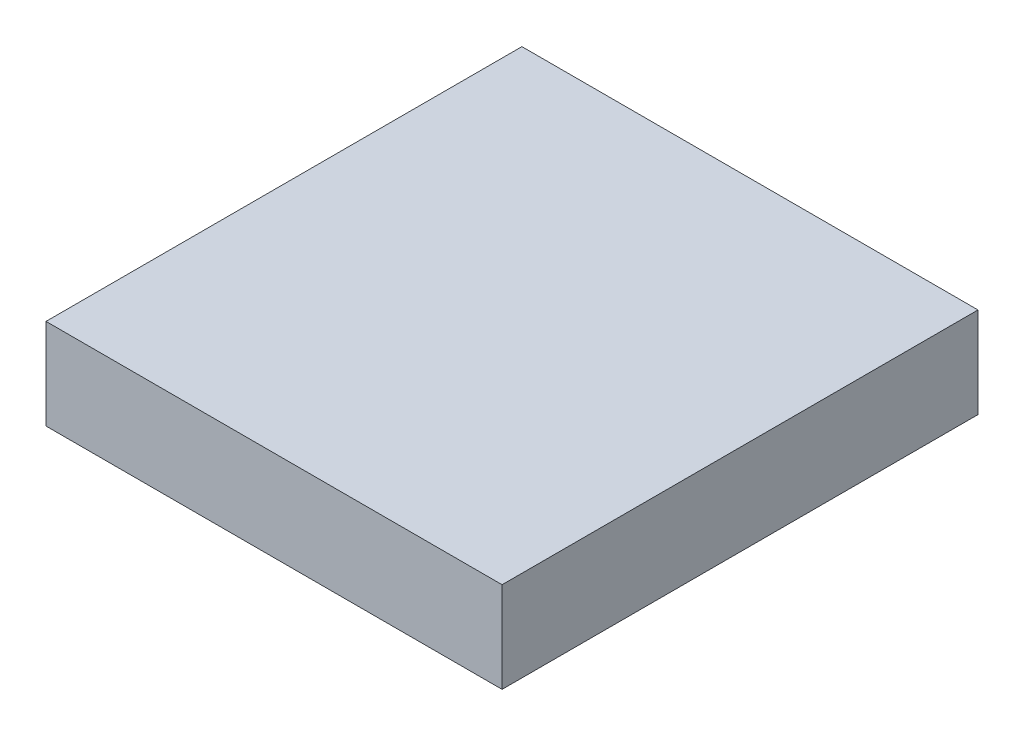
ISO-10303-21;
HEADER;
FILE_DESCRIPTION(('STEP AP214'),'2;1');
FILE_NAME('part.step','',(''),(''),'','','');
FILE_SCHEMA(('AUTOMOTIVE_DESIGN { 1 0 10303 214 1 1 1 1 }'));
ENDSEC;
DATA;
#1=APPLICATION_CONTEXT('core data for automotive mechanical design processes');
#2=APPLICATION_PROTOCOL_DEFINITION('international standard','automotive_design',2000,#1);
#3=PRODUCT_CONTEXT('',#1,'mechanical');
#4=PRODUCT('Part','Part','',(#3));
#5=PRODUCT_RELATED_PRODUCT_CATEGORY('part','',(#4));
#6=PRODUCT_DEFINITION_FORMATION('','',#4);
#7=PRODUCT_DEFINITION_CONTEXT('part definition',#1,'design');
#8=PRODUCT_DEFINITION('design','',#6,#7);
#9=PRODUCT_DEFINITION_SHAPE('','',#8);
#10=(LENGTH_UNIT() NAMED_UNIT(*) SI_UNIT(.MILLI.,.METRE.));
#11=(NAMED_UNIT(*) PLANE_ANGLE_UNIT() SI_UNIT($,.RADIAN.));
#12=(NAMED_UNIT(*) SI_UNIT($,.STERADIAN.) SOLID_ANGLE_UNIT());
#13=UNCERTAINTY_MEASURE_WITH_UNIT(LENGTH_MEASURE(1.E-05),#10,'distance_accuracy_value','');
#14=(GEOMETRIC_REPRESENTATION_CONTEXT(3) GLOBAL_UNCERTAINTY_ASSIGNED_CONTEXT((#13)) GLOBAL_UNIT_ASSIGNED_CONTEXT((#10,
#11,#12)) REPRESENTATION_CONTEXT('',''));
#15=CARTESIAN_POINT('',(0.,0.,0.));
#16=DIRECTION('',(0.,0.,1.));
#17=DIRECTION('',(1.,0.,0.));
#18=AXIS2_PLACEMENT_3D('',#15,#16,#17);
#19=CARTESIAN_POINT('',(-8.05,3.2,-8.4));
#20=DIRECTION('',(1.,0.,0.));
#21=DIRECTION('',(0.,0.,-1.));
#22=AXIS2_PLACEMENT_3D('',#19,#20,#21);
#23=PLANE('',#22);
#24=DIRECTION('',(0.,0.,1.));
#25=VECTOR('',#24,1.);
#26=CARTESIAN_POINT('',(-8.05,0.,-8.4));
#27=LINE('',#26,#25);
#28=CARTESIAN_POINT('',(-8.05,0.,-8.4));
#29=VERTEX_POINT('',#28);
#30=CARTESIAN_POINT('',(-8.05,0.,8.4));
#31=VERTEX_POINT('',#30);
#32=EDGE_CURVE('E98',#29,#31,#27,.T.);
#33=ORIENTED_EDGE('',*,*,#32,.T.);
#34=DIRECTION('',(0.,-1.,0.));
#35=VECTOR('',#34,1.);
#36=CARTESIAN_POINT('',(-8.05,3.2,8.4));
#37=LINE('',#36,#35);
#38=CARTESIAN_POINT('',(-8.05,3.2,8.4));
#39=VERTEX_POINT('',#38);
#40=EDGE_CURVE('E11',#39,#31,#37,.T.);
#41=ORIENTED_EDGE('',*,*,#40,.F.);
#42=DIRECTION('',(0.,0.,1.));
#43=VECTOR('',#42,1.);
#44=CARTESIAN_POINT('',(-8.05,3.2,-8.4));
#45=LINE('',#44,#43);
#46=CARTESIAN_POINT('',(-8.05,3.2,-8.4));
#47=VERTEX_POINT('',#46);
#48=EDGE_CURVE('E86',#47,#39,#45,.T.);
#49=ORIENTED_EDGE('',*,*,#48,.F.);
#50=DIRECTION('',(0.,-1.,0.));
#51=VECTOR('',#50,1.);
#52=CARTESIAN_POINT('',(-8.05,3.2,-8.4));
#53=LINE('',#52,#51);
#54=EDGE_CURVE('E94',#47,#29,#53,.T.);
#55=ORIENTED_EDGE('',*,*,#54,.T.);
#56=EDGE_LOOP('',(#33,#41,#49,#55));
#57=FACE_BOUND('',#56,.T.);
#58=ADVANCED_FACE('F35',(#57),#23,.F.);
#59=CARTESIAN_POINT('',(-8.05,3.2,8.4));
#60=DIRECTION('',(0.,0.,-1.));
#61=DIRECTION('',(-1.,0.,0.));
#62=AXIS2_PLACEMENT_3D('',#59,#60,#61);
#63=PLANE('',#62);
#64=DIRECTION('',(1.,0.,0.));
#65=VECTOR('',#64,1.);
#66=CARTESIAN_POINT('',(-8.05,0.,8.4));
#67=LINE('',#66,#65);
#68=CARTESIAN_POINT('',(8.05,0.,8.4));
#69=VERTEX_POINT('',#68);
#70=EDGE_CURVE('E90',#31,#69,#67,.T.);
#71=ORIENTED_EDGE('',*,*,#70,.T.);
#72=DIRECTION('',(0.,-1.,0.));
#73=VECTOR('',#72,1.);
#74=CARTESIAN_POINT('',(8.05,3.2,8.4));
#75=LINE('',#74,#73);
#76=CARTESIAN_POINT('',(8.05,3.2,8.4));
#77=VERTEX_POINT('',#76);
#78=EDGE_CURVE('E43',#77,#69,#75,.T.);
#79=ORIENTED_EDGE('',*,*,#78,.F.);
#80=DIRECTION('',(1.,0.,0.));
#81=VECTOR('',#80,1.);
#82=CARTESIAN_POINT('',(-8.05,3.2,8.4));
#83=LINE('',#82,#81);
#84=EDGE_CURVE('E81',#39,#77,#83,.T.);
#85=ORIENTED_EDGE('',*,*,#84,.F.);
#86=ORIENTED_EDGE('',*,*,#40,.T.);
#87=EDGE_LOOP('',(#71,#79,#85,#86));
#88=FACE_BOUND('',#87,.T.);
#89=ADVANCED_FACE('F89',(#88),#63,.F.);
#90=CARTESIAN_POINT('',(8.05,3.2,-8.4));
#91=DIRECTION('',(-1.,0.,0.));
#92=DIRECTION('',(0.,0.,1.));
#93=AXIS2_PLACEMENT_3D('',#90,#91,#92);
#94=PLANE('',#93);
#95=DIRECTION('',(0.,0.,-1.));
#96=VECTOR('',#95,1.);
#97=CARTESIAN_POINT('',(8.05,0.,-8.4));
#98=LINE('',#97,#96);
#99=CARTESIAN_POINT('',(8.05,0.,-8.4));
#100=VERTEX_POINT('',#99);
#101=EDGE_CURVE('E68',#69,#100,#98,.T.);
#102=ORIENTED_EDGE('',*,*,#101,.T.);
#103=DIRECTION('',(0.,-1.,0.));
#104=VECTOR('',#103,1.);
#105=CARTESIAN_POINT('',(8.05,3.2,-8.4));
#106=LINE('',#105,#104);
#107=CARTESIAN_POINT('',(8.05,3.2,-8.4));
#108=VERTEX_POINT('',#107);
#109=EDGE_CURVE('E91',#108,#100,#106,.T.);
#110=ORIENTED_EDGE('',*,*,#109,.F.);
#111=DIRECTION('',(0.,0.,-1.));
#112=VECTOR('',#111,1.);
#113=CARTESIAN_POINT('',(8.05,3.2,-8.4));
#114=LINE('',#113,#112);
#115=EDGE_CURVE('E84',#77,#108,#114,.T.);
#116=ORIENTED_EDGE('',*,*,#115,.F.);
#117=ORIENTED_EDGE('',*,*,#78,.T.);
#118=EDGE_LOOP('',(#102,#110,#116,#117));
#119=FACE_BOUND('',#118,.T.);
#120=ADVANCED_FACE('F92',(#119),#94,.F.);
#121=CARTESIAN_POINT('',(-8.05,3.2,-8.4));
#122=DIRECTION('',(0.,0.,1.));
#123=DIRECTION('',(1.,0.,0.));
#124=AXIS2_PLACEMENT_3D('',#121,#122,#123);
#125=PLANE('',#124);
#126=DIRECTION('',(-1.,0.,0.));
#127=VECTOR('',#126,1.);
#128=CARTESIAN_POINT('',(-8.05,0.,-8.4));
#129=LINE('',#128,#127);
#130=EDGE_CURVE('E74',#100,#29,#129,.T.);
#131=ORIENTED_EDGE('',*,*,#130,.T.);
#132=ORIENTED_EDGE('',*,*,#54,.F.);
#133=DIRECTION('',(-1.,0.,0.));
#134=VECTOR('',#133,1.);
#135=CARTESIAN_POINT('',(-8.05,3.2,-8.4));
#136=LINE('',#135,#134);
#137=EDGE_CURVE('E51',#108,#47,#136,.T.);
#138=ORIENTED_EDGE('',*,*,#137,.F.);
#139=ORIENTED_EDGE('',*,*,#109,.T.);
#140=EDGE_LOOP('',(#131,#132,#138,#139));
#141=FACE_BOUND('',#140,.T.);
#142=ADVANCED_FACE('F105',(#141),#125,.F.);
#143=CARTESIAN_POINT('',(0.,3.2,0.));
#144=DIRECTION('',(0.,1.,0.));
#145=DIRECTION('',(0.,0.,1.));
#146=AXIS2_PLACEMENT_3D('',#143,#144,#145);
#147=PLANE('',#146);
#148=ORIENTED_EDGE('',*,*,#48,.T.);
#149=ORIENTED_EDGE('',*,*,#84,.T.);
#150=ORIENTED_EDGE('',*,*,#115,.T.);
#151=ORIENTED_EDGE('',*,*,#137,.T.);
#152=EDGE_LOOP('',(#148,#149,#150,#151));
#153=FACE_BOUND('',#152,.T.);
#154=ADVANCED_FACE('F82',(#153),#147,.T.);
#155=CARTESIAN_POINT('',(0.,0.,0.));
#156=DIRECTION('',(0.,1.,0.));
#157=DIRECTION('',(0.,0.,1.));
#158=AXIS2_PLACEMENT_3D('',#155,#156,#157);
#159=PLANE('',#158);
#160=ORIENTED_EDGE('',*,*,#32,.F.);
#161=ORIENTED_EDGE('',*,*,#130,.F.);
#162=ORIENTED_EDGE('',*,*,#101,.F.);
#163=ORIENTED_EDGE('',*,*,#70,.F.);
#164=EDGE_LOOP('',(#160,#161,#162,#163));
#165=FACE_BOUND('',#164,.T.);
#166=ADVANCED_FACE('F108',(#165),#159,.F.);
#167=CLOSED_SHELL('',(#58,#89,#120,#142,#154,#166));
#168=MANIFOLD_SOLID_BREP('B2',#167);
#169=ADVANCED_BREP_SHAPE_REPRESENTATION('',(#18,#168),#14);
#170=SHAPE_DEFINITION_REPRESENTATION(#9,#169);
ENDSEC;
END-ISO-10303-21;
